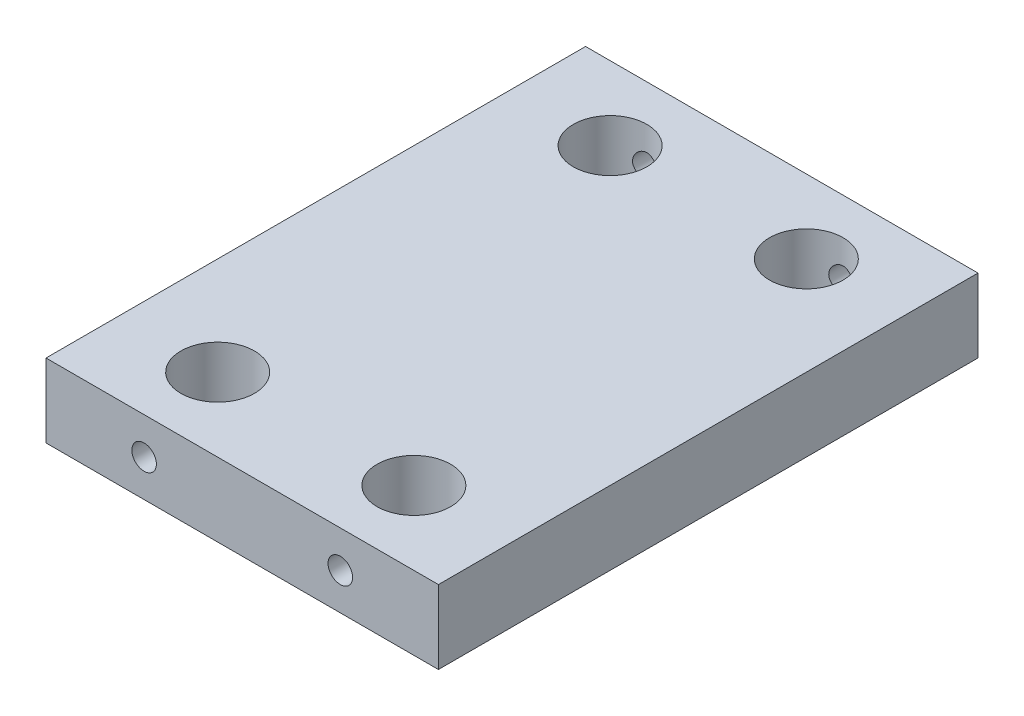
ISO-10303-21;
HEADER;
FILE_DESCRIPTION(('STEP AP214'),'2;1');
FILE_NAME('part.step','',(''),(''),'','','');
FILE_SCHEMA(('AUTOMOTIVE_DESIGN { 1 0 10303 214 1 1 1 1 }'));
ENDSEC;
DATA;
#1=APPLICATION_CONTEXT('core data for automotive mechanical design processes');
#2=APPLICATION_PROTOCOL_DEFINITION('international standard','automotive_design',2000,#1);
#3=PRODUCT_CONTEXT('',#1,'mechanical');
#4=PRODUCT('Part','Part','',(#3));
#5=PRODUCT_RELATED_PRODUCT_CATEGORY('part','',(#4));
#6=PRODUCT_DEFINITION_FORMATION('','',#4);
#7=PRODUCT_DEFINITION_CONTEXT('part definition',#1,'design');
#8=PRODUCT_DEFINITION('design','',#6,#7);
#9=PRODUCT_DEFINITION_SHAPE('','',#8);
#10=(LENGTH_UNIT() NAMED_UNIT(*) SI_UNIT(.MILLI.,.METRE.));
#11=(NAMED_UNIT(*) PLANE_ANGLE_UNIT() SI_UNIT($,.RADIAN.));
#12=(NAMED_UNIT(*) SI_UNIT($,.STERADIAN.) SOLID_ANGLE_UNIT());
#13=UNCERTAINTY_MEASURE_WITH_UNIT(LENGTH_MEASURE(1.E-05),#10,'distance_accuracy_value','');
#14=(GEOMETRIC_REPRESENTATION_CONTEXT(3) GLOBAL_UNCERTAINTY_ASSIGNED_CONTEXT((#13)) GLOBAL_UNIT_ASSIGNED_CONTEXT((#10,
#11,#12)) REPRESENTATION_CONTEXT('',''));
#15=CARTESIAN_POINT('',(0.,0.,0.));
#16=DIRECTION('',(0.,0.,1.));
#17=DIRECTION('',(1.,0.,0.));
#18=AXIS2_PLACEMENT_3D('',#15,#16,#17);
#19=CARTESIAN_POINT('',(50.8,19.05,-69.85));
#20=DIRECTION('',(-1.,0.,0.));
#21=DIRECTION('',(0.,0.,1.));
#22=AXIS2_PLACEMENT_3D('',#19,#20,#21);
#23=PLANE('',#22);
#24=DIRECTION('',(0.,0.,-1.));
#25=VECTOR('',#24,1.);
#26=CARTESIAN_POINT('',(50.8,0.,-69.85));
#27=LINE('',#26,#25);
#28=CARTESIAN_POINT('',(50.8,0.,69.85));
#29=VERTEX_POINT('',#28);
#30=CARTESIAN_POINT('',(50.8,0.,-69.85));
#31=VERTEX_POINT('',#30);
#32=EDGE_CURVE('E102',#29,#31,#27,.T.);
#33=ORIENTED_EDGE('',*,*,#32,.T.);
#34=DIRECTION('',(0.,-1.,0.));
#35=VECTOR('',#34,1.);
#36=CARTESIAN_POINT('',(50.8,19.05,-69.85));
#37=LINE('',#36,#35);
#38=CARTESIAN_POINT('',(50.8,19.05,-69.85));
#39=VERTEX_POINT('',#38);
#40=EDGE_CURVE('E11',#39,#31,#37,.T.);
#41=ORIENTED_EDGE('',*,*,#40,.F.);
#42=DIRECTION('',(0.,0.,-1.));
#43=VECTOR('',#42,1.);
#44=CARTESIAN_POINT('',(50.8,19.05,-69.85));
#45=LINE('',#44,#43);
#46=CARTESIAN_POINT('',(50.8,19.05,69.85));
#47=VERTEX_POINT('',#46);
#48=EDGE_CURVE('E89',#47,#39,#45,.T.);
#49=ORIENTED_EDGE('',*,*,#48,.F.);
#50=DIRECTION('',(0.,-1.,0.));
#51=VECTOR('',#50,1.);
#52=CARTESIAN_POINT('',(50.8,19.05,69.85));
#53=LINE('',#52,#51);
#54=EDGE_CURVE('E98',#47,#29,#53,.T.);
#55=ORIENTED_EDGE('',*,*,#54,.T.);
#56=EDGE_LOOP('',(#33,#41,#49,#55));
#57=FACE_BOUND('',#56,.T.);
#58=ADVANCED_FACE('F32',(#57),#23,.F.);
#59=CARTESIAN_POINT('',(-50.8,19.05,-69.85));
#60=DIRECTION('',(0.,0.,1.));
#61=DIRECTION('',(1.,0.,0.));
#62=AXIS2_PLACEMENT_3D('',#59,#60,#61);
#63=PLANE('',#62);
#64=CARTESIAN_POINT('',(-25.4000000000001,9.525,-69.85));
#65=DIRECTION('',(0.,0.,-1.));
#66=DIRECTION('',(-1.,0.,0.));
#67=AXIS2_PLACEMENT_3D('',#64,#65,#66);
#68=CIRCLE('',#67,3.175);
#69=CARTESIAN_POINT('',(-28.5750000000001,9.525,-69.85));
#70=VERTEX_POINT('',#69);
#71=EDGE_CURVE('E307',#70,#70,#68,.T.);
#72=ORIENTED_EDGE('',*,*,#71,.F.);
#73=EDGE_LOOP('',(#72));
#74=FACE_BOUND('',#73,.T.);
#75=CARTESIAN_POINT('',(25.4000000000001,9.525,-69.85));
#76=DIRECTION('',(0.,0.,-1.));
#77=DIRECTION('',(-1.,0.,0.));
#78=AXIS2_PLACEMENT_3D('',#75,#76,#77);
#79=CIRCLE('',#78,3.175);
#80=CARTESIAN_POINT('',(22.2250000000001,9.525,-69.85));
#81=VERTEX_POINT('',#80);
#82=EDGE_CURVE('E119',#81,#81,#79,.T.);
#83=ORIENTED_EDGE('',*,*,#82,.F.);
#84=EDGE_LOOP('',(#83));
#85=FACE_BOUND('',#84,.T.);
#86=DIRECTION('',(-1.,0.,0.));
#87=VECTOR('',#86,1.);
#88=CARTESIAN_POINT('',(-50.8,0.,-69.85));
#89=LINE('',#88,#87);
#90=CARTESIAN_POINT('',(-50.8,0.,-69.85));
#91=VERTEX_POINT('',#90);
#92=EDGE_CURVE('E93',#31,#91,#89,.T.);
#93=ORIENTED_EDGE('',*,*,#92,.T.);
#94=DIRECTION('',(0.,-1.,0.));
#95=VECTOR('',#94,1.);
#96=CARTESIAN_POINT('',(-50.8,19.05,-69.85));
#97=LINE('',#96,#95);
#98=CARTESIAN_POINT('',(-50.8,19.05,-69.85));
#99=VERTEX_POINT('',#98);
#100=EDGE_CURVE('E45',#99,#91,#97,.T.);
#101=ORIENTED_EDGE('',*,*,#100,.F.);
#102=DIRECTION('',(-1.,0.,0.));
#103=VECTOR('',#102,1.);
#104=CARTESIAN_POINT('',(-50.8,19.05,-69.85));
#105=LINE('',#104,#103);
#106=EDGE_CURVE('E84',#39,#99,#105,.T.);
#107=ORIENTED_EDGE('',*,*,#106,.F.);
#108=ORIENTED_EDGE('',*,*,#40,.T.);
#109=EDGE_LOOP('',(#93,#101,#107,#108));
#110=FACE_BOUND('',#109,.T.);
#111=ADVANCED_FACE('F92',(#74,#85,#110),#63,.F.);
#112=CARTESIAN_POINT('',(-50.8,19.05,-69.85));
#113=DIRECTION('',(1.,0.,0.));
#114=DIRECTION('',(0.,0.,-1.));
#115=AXIS2_PLACEMENT_3D('',#112,#113,#114);
#116=PLANE('',#115);
#117=DIRECTION('',(0.,0.,1.));
#118=VECTOR('',#117,1.);
#119=CARTESIAN_POINT('',(-50.8,0.,-69.85));
#120=LINE('',#119,#118);
#121=CARTESIAN_POINT('',(-50.8,0.,69.85));
#122=VERTEX_POINT('',#121);
#123=EDGE_CURVE('E71',#91,#122,#120,.T.);
#124=ORIENTED_EDGE('',*,*,#123,.T.);
#125=DIRECTION('',(0.,-1.,0.));
#126=VECTOR('',#125,1.);
#127=CARTESIAN_POINT('',(-50.8,19.05,69.85));
#128=LINE('',#127,#126);
#129=CARTESIAN_POINT('',(-50.8,19.05,69.85));
#130=VERTEX_POINT('',#129);
#131=EDGE_CURVE('E94',#130,#122,#128,.T.);
#132=ORIENTED_EDGE('',*,*,#131,.F.);
#133=DIRECTION('',(0.,0.,1.));
#134=VECTOR('',#133,1.);
#135=CARTESIAN_POINT('',(-50.8,19.05,-69.85));
#136=LINE('',#135,#134);
#137=EDGE_CURVE('E87',#99,#130,#136,.T.);
#138=ORIENTED_EDGE('',*,*,#137,.F.);
#139=ORIENTED_EDGE('',*,*,#100,.T.);
#140=EDGE_LOOP('',(#124,#132,#138,#139));
#141=FACE_BOUND('',#140,.T.);
#142=ADVANCED_FACE('F96',(#141),#116,.F.);
#143=CARTESIAN_POINT('',(-50.8,19.05,69.85));
#144=DIRECTION('',(0.,0.,-1.));
#145=DIRECTION('',(-1.,0.,0.));
#146=AXIS2_PLACEMENT_3D('',#143,#144,#145);
#147=PLANE('',#146);
#148=CARTESIAN_POINT('',(-25.4000000000001,9.525,69.85));
#149=DIRECTION('',(0.,0.,1.));
#150=DIRECTION('',(1.,0.,0.));
#151=AXIS2_PLACEMENT_3D('',#148,#149,#150);
#152=CIRCLE('',#151,3.175);
#153=CARTESIAN_POINT('',(-22.2250000000001,9.525,69.85));
#154=VERTEX_POINT('',#153);
#155=EDGE_CURVE('E262',#154,#154,#152,.T.);
#156=ORIENTED_EDGE('',*,*,#155,.F.);
#157=EDGE_LOOP('',(#156));
#158=FACE_BOUND('',#157,.T.);
#159=CARTESIAN_POINT('',(25.4000000000001,9.525,69.85));
#160=DIRECTION('',(0.,0.,1.));
#161=DIRECTION('',(1.,0.,0.));
#162=AXIS2_PLACEMENT_3D('',#159,#160,#161);
#163=CIRCLE('',#162,3.175);
#164=CARTESIAN_POINT('',(28.5750000000001,9.525,69.85));
#165=VERTEX_POINT('',#164);
#166=EDGE_CURVE('E261',#165,#165,#163,.T.);
#167=ORIENTED_EDGE('',*,*,#166,.F.);
#168=EDGE_LOOP('',(#167));
#169=FACE_BOUND('',#168,.T.);
#170=DIRECTION('',(1.,0.,0.));
#171=VECTOR('',#170,1.);
#172=CARTESIAN_POINT('',(-50.8,0.,69.85));
#173=LINE('',#172,#171);
#174=EDGE_CURVE('E77',#122,#29,#173,.T.);
#175=ORIENTED_EDGE('',*,*,#174,.T.);
#176=ORIENTED_EDGE('',*,*,#54,.F.);
#177=DIRECTION('',(1.,0.,0.));
#178=VECTOR('',#177,1.);
#179=CARTESIAN_POINT('',(-50.8,19.05,69.85));
#180=LINE('',#179,#178);
#181=EDGE_CURVE('E54',#130,#47,#180,.T.);
#182=ORIENTED_EDGE('',*,*,#181,.F.);
#183=ORIENTED_EDGE('',*,*,#131,.T.);
#184=EDGE_LOOP('',(#175,#176,#182,#183));
#185=FACE_BOUND('',#184,.T.);
#186=ADVANCED_FACE('F164',(#158,#169,#185),#147,.F.);
#187=CARTESIAN_POINT('',(50.8,19.05,69.85));
#188=DIRECTION('',(0.,1.,0.));
#189=DIRECTION('',(0.,0.,1.));
#190=AXIS2_PLACEMENT_3D('',#187,#188,#189);
#191=PLANE('',#190);
#192=CARTESIAN_POINT('',(25.4,19.05,50.8));
#193=DIRECTION('',(0.,1.,0.));
#194=DIRECTION('',(0.,0.,1.));
#195=AXIS2_PLACEMENT_3D('',#192,#193,#194);
#196=CIRCLE('',#195,9.525);
#197=CARTESIAN_POINT('',(25.4,19.05,60.325));
#198=VERTEX_POINT('',#197);
#199=EDGE_CURVE('E118',#198,#198,#196,.T.);
#200=ORIENTED_EDGE('',*,*,#199,.F.);
#201=EDGE_LOOP('',(#200));
#202=FACE_BOUND('',#201,.T.);
#203=CARTESIAN_POINT('',(25.4,19.05,-50.8));
#204=DIRECTION('',(0.,1.,0.));
#205=DIRECTION('',(0.,0.,1.));
#206=AXIS2_PLACEMENT_3D('',#203,#204,#205);
#207=CIRCLE('',#206,9.525);
#208=CARTESIAN_POINT('',(25.4,19.05,-41.275));
#209=VERTEX_POINT('',#208);
#210=EDGE_CURVE('E282',#209,#209,#207,.T.);
#211=ORIENTED_EDGE('',*,*,#210,.F.);
#212=EDGE_LOOP('',(#211));
#213=FACE_BOUND('',#212,.T.);
#214=CARTESIAN_POINT('',(-25.4,19.05,50.8));
#215=DIRECTION('',(0.,1.,0.));
#216=DIRECTION('',(0.,0.,1.));
#217=AXIS2_PLACEMENT_3D('',#214,#215,#216);
#218=CIRCLE('',#217,9.525);
#219=CARTESIAN_POINT('',(-25.4,19.05,60.325));
#220=VERTEX_POINT('',#219);
#221=EDGE_CURVE('E275',#220,#220,#218,.T.);
#222=ORIENTED_EDGE('',*,*,#221,.F.);
#223=EDGE_LOOP('',(#222));
#224=FACE_BOUND('',#223,.T.);
#225=CARTESIAN_POINT('',(-25.4,19.05,-50.8));
#226=DIRECTION('',(0.,1.,0.));
#227=DIRECTION('',(0.,0.,1.));
#228=AXIS2_PLACEMENT_3D('',#225,#226,#227);
#229=CIRCLE('',#228,9.525);
#230=CARTESIAN_POINT('',(-25.4,19.05,-41.275));
#231=VERTEX_POINT('',#230);
#232=EDGE_CURVE('E279',#231,#231,#229,.T.);
#233=ORIENTED_EDGE('',*,*,#232,.F.);
#234=EDGE_LOOP('',(#233));
#235=FACE_BOUND('',#234,.T.);
#236=ORIENTED_EDGE('',*,*,#48,.T.);
#237=ORIENTED_EDGE('',*,*,#106,.T.);
#238=ORIENTED_EDGE('',*,*,#137,.T.);
#239=ORIENTED_EDGE('',*,*,#181,.T.);
#240=EDGE_LOOP('',(#236,#237,#238,#239));
#241=FACE_BOUND('',#240,.T.);
#242=ADVANCED_FACE('F85',(#202,#213,#224,#235,#241),#191,.T.);
#243=CARTESIAN_POINT('',(50.8,0.,69.85));
#244=DIRECTION('',(0.,1.,0.));
#245=DIRECTION('',(0.,0.,1.));
#246=AXIS2_PLACEMENT_3D('',#243,#244,#245);
#247=PLANE('',#246);
#248=CARTESIAN_POINT('',(25.4,0.,50.8));
#249=DIRECTION('',(0.,1.,0.));
#250=DIRECTION('',(0.,0.,1.));
#251=AXIS2_PLACEMENT_3D('',#248,#249,#250);
#252=CIRCLE('',#251,9.525);
#253=CARTESIAN_POINT('',(25.4,0.,60.325));
#254=VERTEX_POINT('',#253);
#255=EDGE_CURVE('E297',#254,#254,#252,.T.);
#256=ORIENTED_EDGE('',*,*,#255,.T.);
#257=EDGE_LOOP('',(#256));
#258=FACE_BOUND('',#257,.T.);
#259=CARTESIAN_POINT('',(25.4,0.,-50.8));
#260=DIRECTION('',(0.,1.,0.));
#261=DIRECTION('',(0.,0.,1.));
#262=AXIS2_PLACEMENT_3D('',#259,#260,#261);
#263=CIRCLE('',#262,9.525);
#264=CARTESIAN_POINT('',(25.4,0.,-41.275));
#265=VERTEX_POINT('',#264);
#266=EDGE_CURVE('E277',#265,#265,#263,.T.);
#267=ORIENTED_EDGE('',*,*,#266,.T.);
#268=EDGE_LOOP('',(#267));
#269=FACE_BOUND('',#268,.T.);
#270=CARTESIAN_POINT('',(-25.4,0.,50.8));
#271=DIRECTION('',(0.,1.,0.));
#272=DIRECTION('',(0.,0.,1.));
#273=AXIS2_PLACEMENT_3D('',#270,#271,#272);
#274=CIRCLE('',#273,9.525);
#275=CARTESIAN_POINT('',(-25.4,0.,60.325));
#276=VERTEX_POINT('',#275);
#277=EDGE_CURVE('E272',#276,#276,#274,.T.);
#278=ORIENTED_EDGE('',*,*,#277,.T.);
#279=EDGE_LOOP('',(#278));
#280=FACE_BOUND('',#279,.T.);
#281=CARTESIAN_POINT('',(-25.4,0.,-50.8));
#282=DIRECTION('',(0.,1.,0.));
#283=DIRECTION('',(0.,0.,1.));
#284=AXIS2_PLACEMENT_3D('',#281,#282,#283);
#285=CIRCLE('',#284,9.525);
#286=CARTESIAN_POINT('',(-25.4,0.,-41.275));
#287=VERTEX_POINT('',#286);
#288=EDGE_CURVE('E105',#287,#287,#285,.T.);
#289=ORIENTED_EDGE('',*,*,#288,.T.);
#290=EDGE_LOOP('',(#289));
#291=FACE_BOUND('',#290,.T.);
#292=ORIENTED_EDGE('',*,*,#32,.F.);
#293=ORIENTED_EDGE('',*,*,#174,.F.);
#294=ORIENTED_EDGE('',*,*,#123,.F.);
#295=ORIENTED_EDGE('',*,*,#92,.F.);
#296=EDGE_LOOP('',(#292,#293,#294,#295));
#297=FACE_BOUND('',#296,.T.);
#298=ADVANCED_FACE('F154',(#258,#269,#280,#291,#297),#247,.F.);
#299=CARTESIAN_POINT('',(-25.4,19.05,-50.8));
#300=DIRECTION('',(0.,1.,0.));
#301=DIRECTION('',(0.,0.,1.));
#302=AXIS2_PLACEMENT_3D('',#299,#300,#301);
#303=CYLINDRICAL_SURFACE('',#302,9.525);
#304=CARTESIAN_POINT('',(-28.5750000000001,9.525,-59.7802561210691));
#305=CARTESIAN_POINT('',(-28.575000818984,9.69793645510453,-59.7802555513413));
#306=CARTESIAN_POINT('',(-28.5608229382016,9.87086798943991,-59.7853061749847));
#307=CARTESIAN_POINT('',(-28.504677343112,10.2116077866567,-59.8048579770798));
#308=CARTESIAN_POINT('',(-28.4627050511347,10.3794152008451,-59.8193607122645));
#309=CARTESIAN_POINT('',(-28.3526086670496,10.7049153852664,-59.8559954671191));
#310=CARTESIAN_POINT('',(-28.2845358279554,10.8626272759806,-59.8781125260894));
#311=CARTESIAN_POINT('',(-28.1243456703014,11.1644431541398,-59.9274621238278));
#312=CARTESIAN_POINT('',(-28.0322230466311,11.3085441296078,-59.9546957908897));
#313=CARTESIAN_POINT('',(-27.8226873899562,11.5846858804241,-60.0124050386873));
#314=CARTESIAN_POINT('',(-27.704492283875,11.7161164860327,-60.0429614113174));
#315=CARTESIAN_POINT('',(-27.4478358434058,11.9577065938882,-60.1031902074318));
#316=CARTESIAN_POINT('',(-27.3093712607914,12.067862680274,-60.1328624883195));
#317=CARTESIAN_POINT('',(-27.011644312789,12.2665454990215,-60.1889152747671));
#318=CARTESIAN_POINT('',(-26.8519335681379,12.354432906712,-60.215189694526));
#319=CARTESIAN_POINT('',(-26.5189691329853,12.5018532827798,-60.2605343799787));
#320=CARTESIAN_POINT('',(-26.345719107057,12.5613938928367,-60.2796065869453));
#321=CARTESIAN_POINT('',(-25.9969914953514,12.6483613384578,-60.307825644963));
#322=CARTESIAN_POINT('',(-25.8218011466582,12.676833441866,-60.3172947441875));
#323=CARTESIAN_POINT('',(-25.4688907525666,12.7041792314201,-60.3263845609294));
#324=CARTESIAN_POINT('',(-25.2911713709982,12.7030605464964,-60.3260078168469));
#325=CARTESIAN_POINT('',(-24.9456463392597,12.6719194917529,-60.3156667578947));
#326=CARTESIAN_POINT('',(-24.7777252457216,12.6430324720935,-60.306079055975));
#327=CARTESIAN_POINT('',(-24.4492670817397,12.559052285387,-60.2788662130365));
#328=CARTESIAN_POINT('',(-24.2887305125511,12.5039573422391,-60.26124052729));
#329=CARTESIAN_POINT('',(-23.9771158923768,12.3684623175533,-60.2194525318099));
#330=CARTESIAN_POINT('',(-23.826189898424,12.2877391451148,-60.1952073501375));
#331=CARTESIAN_POINT('',(-23.5396902664508,12.1035454352005,-60.1427039789857));
#332=CARTESIAN_POINT('',(-23.4041209133266,12.0000685724348,-60.1144446743966));
#333=CARTESIAN_POINT('',(-23.1454297486997,11.7675838007655,-60.0553215912342));
#334=CARTESIAN_POINT('',(-23.0231945013178,11.6376032238533,-60.0243978316119));
#335=CARTESIAN_POINT('',(-22.8019697007759,11.358725295818,-59.9645528941526));
#336=CARTESIAN_POINT('',(-22.7029837300812,11.2098250348135,-59.9356320254233));
#337=CARTESIAN_POINT('',(-22.5298398302616,10.8945247387091,-59.8827391725953));
#338=CARTESIAN_POINT('',(-22.4560559780023,10.7279054830661,-59.8588436197908));
#339=CARTESIAN_POINT('',(-22.3378928613699,10.3836108233692,-59.8195924136742));
#340=CARTESIAN_POINT('',(-22.2935012735018,10.2059400871702,-59.8042331817152));
#341=CARTESIAN_POINT('',(-22.2371879293404,9.85317322156826,-59.7846034530198));
#342=CARTESIAN_POINT('',(-22.2238916217633,9.67832257642302,-59.7798639401205));
#343=CARTESIAN_POINT('',(-22.2262527314617,9.32886072656272,-59.7806993378791));
#344=CARTESIAN_POINT('',(-22.2419048899051,9.15424948412384,-59.7862723751401));
#345=CARTESIAN_POINT('',(-22.3004835563215,8.81647663386469,-59.806637374367));
#346=CARTESIAN_POINT('',(-22.3424546991114,8.65312775927108,-59.8211060827467));
#347=CARTESIAN_POINT('',(-22.4513334863706,8.33582405019059,-59.857276579055));
#348=CARTESIAN_POINT('',(-22.5182455515462,8.18187088669928,-59.8789796491812));
#349=CARTESIAN_POINT('',(-22.6775189681539,7.88231716381078,-59.9280258636662));
#350=CARTESIAN_POINT('',(-22.7706201992118,7.73713640961228,-59.9555260648837));
#351=CARTESIAN_POINT('',(-22.9787906229798,7.46396128368169,-60.0127631572082));
#352=CARTESIAN_POINT('',(-23.0938662915414,7.33597199725063,-60.0425007060905));
#353=CARTESIAN_POINT('',(-23.3492938337665,7.09444865051222,-60.1025924767517));
#354=CARTESIAN_POINT('',(-23.4905954160144,6.98190631169015,-60.1329075335982));
#355=CARTESIAN_POINT('',(-23.7908233498042,6.78206624804496,-60.1893275387162));
#356=CARTESIAN_POINT('',(-23.9497490750551,6.69476762655931,-60.2154326365118));
#357=CARTESIAN_POINT('',(-24.2799239367775,6.54869116706406,-60.2603698844866));
#358=CARTESIAN_POINT('',(-24.4510841834553,6.48972769505489,-60.2792492026439));
#359=CARTESIAN_POINT('',(-24.801644370939,6.40166441895917,-60.3078108940993));
#360=CARTESIAN_POINT('',(-24.9810413130465,6.37255383512941,-60.3174965870801));
#361=CARTESIAN_POINT('',(-25.3339113086444,6.34599290360209,-60.3263291577511));
#362=CARTESIAN_POINT('',(-25.5072664984461,6.34711883376471,-60.3259499628397));
#363=CARTESIAN_POINT('',(-25.8512028853756,6.37748695336485,-60.3158622394909));
#364=CARTESIAN_POINT('',(-26.0217843064006,6.40672686188505,-60.306154467891));
#365=CARTESIAN_POINT('',(-26.3526337291968,6.49154859477868,-60.2786740498026));
#366=CARTESIAN_POINT('',(-26.5130225101482,6.54670463374557,-60.2610319529665));
#367=CARTESIAN_POINT('',(-26.8223312642339,6.68139866123347,-60.2194998523677));
#368=CARTESIAN_POINT('',(-26.9712491566523,6.76094106025052,-60.1956087185245));
#369=CARTESIAN_POINT('',(-27.2593880017805,6.94553320092388,-60.1429413352852));
#370=CARTESIAN_POINT('',(-27.3980473486955,7.05141682608671,-60.1140172016187));
#371=CARTESIAN_POINT('',(-27.656094758415,7.28426721692092,-60.0549023941422));
#372=CARTESIAN_POINT('',(-27.7754766486581,7.41124070918416,-60.0247113185458));
#373=CARTESIAN_POINT('',(-27.9963302430452,7.68860970398856,-59.9650591344627));
#374=CARTESIAN_POINT('',(-28.0969179170434,7.83972749735083,-59.935672863639));
#375=CARTESIAN_POINT('',(-28.2711980399811,8.15763680541632,-59.8824111380057));
#376=CARTESIAN_POINT('',(-28.3448975164019,8.32442421036919,-59.8585342438696));
#377=CARTESIAN_POINT('',(-28.4602041545483,8.66127879124963,-59.8202173610568));
#378=CARTESIAN_POINT('',(-28.5031113615498,8.83085693669304,-59.8053995932155));
#379=CARTESIAN_POINT('',(-28.560503966474,9.17529296023178,-59.7854209273797));
#380=CARTESIAN_POINT('',(-28.5749991719492,9.350148995279,-59.7802566971044));
#381=CARTESIAN_POINT('',(-28.5750000000001,9.525,-59.7802561210691));
#382=B_SPLINE_CURVE_WITH_KNOTS('',3,(#304,#305,#306,#307,#308,#309,#310,#311,#312,#313,#314,
#315,#316,#317,#318,#319,#320,#321,#322,#323,#324,#325,#326,#327,#328,#329,#330,#331,#332,#333,
#334,#335,#336,#337,#338,#339,#340,#341,#342,#343,#344,#345,#346,#347,#348,#349,#350,#351,#352,
#353,#354,#355,#356,#357,#358,#359,#360,#361,#362,#363,#364,#365,#366,#367,#368,#369,#370,#371,
#372,#373,#374,#375,#376,#377,#378,#379,#380,#381),.UNSPECIFIED.,.T.,.F.,(4,2,2,2,2,2,2,2,2,2,2,
2,2,2,2,2,2,2,2,2,2,2,2,2,2,2,2,2,2,2,2,2,2,2,2,2,2,2,4),(0.,0.518161856737954,1.03640907467314,
1.55364379231512,2.07099270263877,2.60671746332528,3.14252816921061,3.69231882006111,
4.24196117528055,4.77247962078665,5.30286129234889,5.81244090321181,6.32205505300826,
6.83836754181563,7.35482374200019,7.89559553605437,8.43645060268435,8.985016315017,
9.53335188057253,10.0569487508209,10.5804505128322,11.0859695656586,11.5915782629155,
12.1132237331089,12.6350231697725,13.1819271594322,13.7288117205516,14.2720628703095,
14.815117785382,15.3326491885149,15.8501386073105,16.3594083542836,16.8687702617329,
17.3969527447801,17.925304015736,18.4743376618726,19.023227709973,19.5473069861654,
20.0712053232972),.UNSPECIFIED.);
#383=CARTESIAN_POINT('',(-28.5750000000001,9.525,-59.7802561210691));
#384=VERTEX_POINT('',#383);
#385=EDGE_CURVE('E35',#384,#384,#382,.T.);
#386=ORIENTED_EDGE('',*,*,#385,.T.);
#387=EDGE_LOOP('',(#386));
#388=FACE_BOUND('',#387,.T.);
#389=ORIENTED_EDGE('',*,*,#288,.F.);
#390=EDGE_LOOP('',(#389));
#391=FACE_BOUND('',#390,.T.);
#392=ORIENTED_EDGE('',*,*,#232,.T.);
#393=EDGE_LOOP('',(#392));
#394=FACE_BOUND('',#393,.T.);
#395=ADVANCED_FACE('F156',(#388,#391,#394),#303,.F.);
#396=CARTESIAN_POINT('',(-25.4,19.05,50.8));
#397=DIRECTION('',(0.,1.,0.));
#398=DIRECTION('',(0.,0.,1.));
#399=AXIS2_PLACEMENT_3D('',#396,#397,#398);
#400=CYLINDRICAL_SURFACE('',#399,9.525);
#401=CARTESIAN_POINT('',(-25.4,6.35,60.325));
#402=CARTESIAN_POINT('',(-25.2267613228347,6.34999919440205,60.325000485805));
#403=CARTESIAN_POINT('',(-25.0535275073401,6.36422484495392,60.3202301818645));
#404=CARTESIAN_POINT('',(-24.7121624092283,6.42057742049469,60.3016704239542));
#405=CARTESIAN_POINT('',(-24.5440316582228,6.46270724203785,60.2878800336683));
#406=CARTESIAN_POINT('',(-24.2178433933319,6.57326359774438,60.2527785260295));
#407=CARTESIAN_POINT('',(-24.0597695528119,6.64164617330822,60.2314799854546));
#408=CARTESIAN_POINT('',(-23.7573345756431,6.80256822376179,60.1835361515256));
#409=CARTESIAN_POINT('',(-23.6129761516561,6.8951124638833,60.1568898037019));
#410=CARTESIAN_POINT('',(-23.3370701818043,7.10509693042659,60.1000224985654));
#411=CARTESIAN_POINT('',(-23.2060632515529,7.22322416877712,60.0697159177252));
#412=CARTESIAN_POINT('',(-22.9653062006709,7.4795607161934,60.0094149943641));
#413=CARTESIAN_POINT('',(-22.855560761071,7.61777443589808,59.9794207219749));
#414=CARTESIAN_POINT('',(-22.6573558084266,7.91522774074882,59.9221983061534));
#415=CARTESIAN_POINT('',(-22.5695990751483,8.07495762364955,59.8950744970031));
#416=CARTESIAN_POINT('',(-22.4224250754383,8.40795909990595,59.8479659470406));
#417=CARTESIAN_POINT('',(-22.3629991607971,8.58122654199178,59.8279790281037));
#418=CARTESIAN_POINT('',(-22.2762017597085,8.93023747825212,59.7983088788027));
#419=CARTESIAN_POINT('',(-22.2478173017372,9.10570063695285,59.7883010406852));
#420=CARTESIAN_POINT('',(-22.2207419334131,9.45916241944499,59.7787620979869));
#421=CARTESIAN_POINT('',(-22.2220418474051,9.63716024275174,59.7792277559717));
#422=CARTESIAN_POINT('',(-22.2535118057417,9.98199880165983,59.7902987265097));
#423=CARTESIAN_POINT('',(-22.2823598256949,10.1489776792679,59.8004397037942));
#424=CARTESIAN_POINT('',(-22.3659504329532,10.4755741072518,59.8289588827545));
#425=CARTESIAN_POINT('',(-22.4206961205709,10.6351907737564,59.8473380706454));
#426=CARTESIAN_POINT('',(-22.5553934906589,10.945535479953,59.8905936784172));
#427=CARTESIAN_POINT('',(-22.6357368953545,11.0960789808658,59.9155699639315));
#428=CARTESIAN_POINT('',(-22.8190770874876,11.3819651337882,59.9691637347793));
#429=CARTESIAN_POINT('',(-22.9220804182444,11.5173033780135,59.9977822708472));
#430=CARTESIAN_POINT('',(-23.154165868734,11.7763658241605,60.0572627010758));
#431=CARTESIAN_POINT('',(-23.2843287485078,11.8991148050663,60.0881637120163));
#432=CARTESIAN_POINT('',(-23.5637718653452,12.1212967716563,60.1474202937884));
#433=CARTESIAN_POINT('',(-23.713053933777,12.2207275211723,60.1757756203337));
#434=CARTESIAN_POINT('',(-24.0285663285782,12.3942357532464,60.227118177025));
#435=CARTESIAN_POINT('',(-24.1949500973783,12.4680519350068,60.2500493627553));
#436=CARTESIAN_POINT('',(-24.5387206603178,12.5863450773094,60.2875530068358));
#437=CARTESIAN_POINT('',(-24.7161036088582,12.6308322294694,60.3021283685424));
#438=CARTESIAN_POINT('',(-25.0685813412446,12.687476739621,60.3207971595182));
#439=CARTESIAN_POINT('',(-25.2434420204292,12.7009518941235,60.3253175582209));
#440=CARTESIAN_POINT('',(-25.5929608471239,12.6989437613249,60.3246476605608));
#441=CARTESIAN_POINT('',(-25.76761902384,12.6834653620639,60.3194590033147));
#442=CARTESIAN_POINT('',(-26.1065005755161,12.6250321929383,60.300235784768));
#443=CARTESIAN_POINT('',(-26.2708796617008,12.5828862957928,60.2864618090803));
#444=CARTESIAN_POINT('',(-26.5901676684903,12.4733258138181,60.2517161368547));
#445=CARTESIAN_POINT('',(-26.7450753785149,12.4059080066898,60.2307435224819));
#446=CARTESIAN_POINT('',(-27.0455653410488,12.2457513789055,60.1830435683714));
#447=CARTESIAN_POINT('',(-27.1907951205146,12.1523931663259,60.1561793684962));
#448=CARTESIAN_POINT('',(-27.4639558356806,11.9437335737071,60.0997418118413));
#449=CARTESIAN_POINT('',(-27.5918814677511,11.8284254920991,60.070167629104));
#450=CARTESIAN_POINT('',(-27.8328517122851,11.572942465554,60.0099399233791));
#451=CARTESIAN_POINT('',(-27.9449560773554,11.4318757045072,59.9792984145258));
#452=CARTESIAN_POINT('',(-28.1440176333774,11.1322752722004,59.921774152107));
#453=CARTESIAN_POINT('',(-28.2309746146811,10.9737414553367,59.8948914298785));
#454=CARTESIAN_POINT('',(-28.376870254072,10.6436381764545,59.8481909393764));
#455=CARTESIAN_POINT('',(-28.435865569624,10.4720958986391,59.828358905177));
#456=CARTESIAN_POINT('',(-28.523865566961,10.1206977861098,59.7982939257297));
#457=CARTESIAN_POINT('',(-28.5528837594788,9.94084573484112,59.7880566563005));
#458=CARTESIAN_POINT('',(-28.5790521968656,9.58787422007002,59.7788320192551));
#459=CARTESIAN_POINT('',(-28.5777630669542,9.41488356958927,59.7792937081729));
#460=CARTESIAN_POINT('',(-28.5471942816996,9.07172088712239,59.7900528169078));
#461=CARTESIAN_POINT('',(-28.5179162922811,8.90154868799253,59.8003496513272));
#462=CARTESIAN_POINT('',(-28.4333055066857,8.57206926996709,59.8292086466803));
#463=CARTESIAN_POINT('',(-28.3784781235993,8.41261708061067,59.8476101122136));
#464=CARTESIAN_POINT('',(-28.2447344862872,8.10505298297094,59.8905456624864));
#465=CARTESIAN_POINT('',(-28.1658128851584,7.95694360097803,59.9150811082377));
#466=CARTESIAN_POINT('',(-27.9821026989524,7.66926434799471,59.968854827927));
#467=CARTESIAN_POINT('',(-27.8763356707776,7.53034910647258,59.9982515946378));
#468=CARTESIAN_POINT('',(-27.6435911539557,7.27173484250512,60.0577715619933));
#469=CARTESIAN_POINT('',(-27.5166076681335,7.15204127219033,60.0878949659678));
#470=CARTESIAN_POINT('',(-27.2390919432232,6.93056649098183,60.146883469186));
#471=CARTESIAN_POINT('',(-27.0878348053616,6.82966519589055,60.1756537721899));
#472=CARTESIAN_POINT('',(-26.769559609766,6.65483038839917,60.2274002197304));
#473=CARTESIAN_POINT('',(-26.6025455950702,6.58088998169749,60.2503778450768));
#474=CARTESIAN_POINT('',(-26.2651673298631,6.46518381684845,60.2870751034262));
#475=CARTESIAN_POINT('',(-26.0952861306226,6.42212816961377,60.3011624944151));
#476=CARTESIAN_POINT('',(-25.7502673208325,6.36454060885012,60.320123424289));
#477=CARTESIAN_POINT('',(-25.5751311761808,6.3500008143985,60.324999508888));
#478=CARTESIAN_POINT('',(-25.4,6.35,60.325));
#479=B_SPLINE_CURVE_WITH_KNOTS('',3,(#401,#402,#403,#404,#405,#406,#407,#408,#409,#410,#411,
#412,#413,#414,#415,#416,#417,#418,#419,#420,#421,#422,#423,#424,#425,#426,#427,#428,#429,#430,
#431,#432,#433,#434,#435,#436,#437,#438,#439,#440,#441,#442,#443,#444,#445,#446,#447,#448,#449,
#450,#451,#452,#453,#454,#455,#456,#457,#458,#459,#460,#461,#462,#463,#464,#465,#466,#467,#468,
#469,#470,#471,#472,#473,#474,#475,#476,#477,#478),.UNSPECIFIED.,.T.,.F.,(4,2,2,2,2,2,2,2,2,2,2,
2,2,2,2,2,2,2,2,2,2,2,2,2,2,2,2,2,2,2,2,2,2,2,2,2,2,2,4),(0.,0.519071561632583,1.03819701322438,
1.55645698636312,2.07481924951214,2.6093637259775,3.14402575687909,3.69406121814519,
4.24392866899746,4.77526114230342,5.30642937910266,5.81332424300314,6.32027980466155,
6.83539943417539,7.35066800622308,7.8928374595109,8.43505888444013,8.98265937939885,
9.53006948685135,10.0537512658116,10.5773446429626,11.0857715158083,11.5942632377703,
12.1161301950386,12.638156741095,13.1839024764639,13.7296527614611,14.274292439,
14.8186865394104,15.3351123975402,15.8515075194061,16.3580948898032,16.8647947620873,
17.3936046174648,17.92256420318,18.4721392315144,19.0215736265905,19.5464607283686,
20.0712027467109),.UNSPECIFIED.);
#480=CARTESIAN_POINT('',(-25.4,6.35,60.325));
#481=VERTEX_POINT('',#480);
#482=EDGE_CURVE('E257',#481,#481,#479,.T.);
#483=ORIENTED_EDGE('',*,*,#482,.T.);
#484=EDGE_LOOP('',(#483));
#485=FACE_BOUND('',#484,.T.);
#486=ORIENTED_EDGE('',*,*,#277,.F.);
#487=EDGE_LOOP('',(#486));
#488=FACE_BOUND('',#487,.T.);
#489=ORIENTED_EDGE('',*,*,#221,.T.);
#490=EDGE_LOOP('',(#489));
#491=FACE_BOUND('',#490,.T.);
#492=ADVANCED_FACE('F142',(#485,#488,#491),#400,.F.);
#493=CARTESIAN_POINT('',(25.4,19.05,-50.8));
#494=DIRECTION('',(0.,1.,0.));
#495=DIRECTION('',(0.,0.,1.));
#496=AXIS2_PLACEMENT_3D('',#493,#494,#495);
#497=CYLINDRICAL_SURFACE('',#496,9.525);
#498=CARTESIAN_POINT('',(22.2250000000001,9.525,-59.7802561210692));
#499=CARTESIAN_POINT('',(22.2249991810161,9.69793645510453,-59.7802555513413));
#500=CARTESIAN_POINT('',(22.2391770617985,9.87086798943991,-59.7853061749847));
#501=CARTESIAN_POINT('',(22.2953226568881,10.2116077866567,-59.8048579770799));
#502=CARTESIAN_POINT('',(22.3372949488654,10.3794152008451,-59.8193607122645));
#503=CARTESIAN_POINT('',(22.4473913329505,10.7049153852664,-59.8559954671192));
#504=CARTESIAN_POINT('',(22.5154641720448,10.8626272759806,-59.8781125260895));
#505=CARTESIAN_POINT('',(22.6756543296987,11.1644431541398,-59.9274621238278));
#506=CARTESIAN_POINT('',(22.767776953369,11.3085441296078,-59.9546957908897));
#507=CARTESIAN_POINT('',(22.9773126100439,11.5846858804241,-60.0124050386873));
#508=CARTESIAN_POINT('',(23.0955077161252,11.7161164860327,-60.0429614113175));
#509=CARTESIAN_POINT('',(23.3521641565944,11.9577065938882,-60.1031902074319));
#510=CARTESIAN_POINT('',(23.4906287392088,12.067862680274,-60.1328624883195));
#511=CARTESIAN_POINT('',(23.7883556872112,12.2665454990215,-60.1889152747671));
#512=CARTESIAN_POINT('',(23.9480664318622,12.354432906712,-60.215189694526));
#513=CARTESIAN_POINT('',(24.2810308670148,12.5018532827798,-60.2605343799787));
#514=CARTESIAN_POINT('',(24.4542808929432,12.5613938928367,-60.2796065869453));
#515=CARTESIAN_POINT('',(24.8030085046487,12.6483613384578,-60.307825644963));
#516=CARTESIAN_POINT('',(24.9781988533419,12.676833441866,-60.3172947441875));
#517=CARTESIAN_POINT('',(25.3311092474336,12.7041792314201,-60.3263845609294));
#518=CARTESIAN_POINT('',(25.5088286290019,12.7030605464964,-60.3260078168469));
#519=CARTESIAN_POINT('',(25.8543536607404,12.6719194917529,-60.3156667578947));
#520=CARTESIAN_POINT('',(26.0222747542786,12.6430324720935,-60.306079055975));
#521=CARTESIAN_POINT('',(26.3507329182605,12.559052285387,-60.2788662130365));
#522=CARTESIAN_POINT('',(26.5112694874491,12.5039573422391,-60.26124052729));
#523=CARTESIAN_POINT('',(26.8228841076233,12.3684623175533,-60.2194525318098));
#524=CARTESIAN_POINT('',(26.9738101015761,12.2877391451148,-60.1952073501375));
#525=CARTESIAN_POINT('',(27.2603097335493,12.1035454352005,-60.1427039789857));
#526=CARTESIAN_POINT('',(27.3958790866735,12.0000685724348,-60.1144446743966));
#527=CARTESIAN_POINT('',(27.6545702513005,11.7675838007655,-60.0553215912342));
#528=CARTESIAN_POINT('',(27.7768054986823,11.6376032238533,-60.0243978316118));
#529=CARTESIAN_POINT('',(27.9980302992243,11.358725295818,-59.9645528941526));
#530=CARTESIAN_POINT('',(28.097016269919,11.2098250348135,-59.9356320254233));
#531=CARTESIAN_POINT('',(28.2701601697385,10.8945247387091,-59.8827391725953));
#532=CARTESIAN_POINT('',(28.3439440219978,10.7279054830661,-59.8588436197907));
#533=CARTESIAN_POINT('',(28.4621071386302,10.3836108233692,-59.8195924136742));
#534=CARTESIAN_POINT('',(28.5064987264984,10.2059400871702,-59.8042331817152));
#535=CARTESIAN_POINT('',(28.5628120706597,9.85317322156825,-59.7846034530198));
#536=CARTESIAN_POINT('',(28.5761083782368,9.67832257642301,-59.7798639401205));
#537=CARTESIAN_POINT('',(28.5737472685384,9.32886072656271,-59.7806993378791));
#538=CARTESIAN_POINT('',(28.558095110095,9.15424948412383,-59.7862723751401));
#539=CARTESIAN_POINT('',(28.4995164436786,8.81647663386469,-59.806637374367));
#540=CARTESIAN_POINT('',(28.4575453008887,8.65312775927108,-59.8211060827467));
#541=CARTESIAN_POINT('',(28.3486665136295,8.33582405019059,-59.857276579055));
#542=CARTESIAN_POINT('',(28.2817544484539,8.18187088669928,-59.8789796491811));
#543=CARTESIAN_POINT('',(28.1224810318462,7.88231716381078,-59.9280258636662));
#544=CARTESIAN_POINT('',(28.0293798007883,7.73713640961228,-59.9555260648837));
#545=CARTESIAN_POINT('',(27.8212093770203,7.46396128368169,-60.0127631572081));
#546=CARTESIAN_POINT('',(27.7061337084587,7.33597199725063,-60.0425007060905));
#547=CARTESIAN_POINT('',(27.4507061662336,7.09444865051223,-60.1025924767517));
#548=CARTESIAN_POINT('',(27.3094045839857,6.98190631169016,-60.1329075335982));
#549=CARTESIAN_POINT('',(27.0091766501959,6.78206624804497,-60.1893275387162));
#550=CARTESIAN_POINT('',(26.850250924945,6.69476762655931,-60.2154326365118));
#551=CARTESIAN_POINT('',(26.5200760632226,6.54869116706406,-60.2603698844866));
#552=CARTESIAN_POINT('',(26.3489158165449,6.4897276950549,-60.2792492026439));
#553=CARTESIAN_POINT('',(25.9983556290612,6.40166441895917,-60.3078108940993));
#554=CARTESIAN_POINT('',(25.8189586869537,6.37255383512941,-60.3174965870801));
#555=CARTESIAN_POINT('',(25.4660886913557,6.34599290360209,-60.3263291577511));
#556=CARTESIAN_POINT('',(25.292733501554,6.34711883376471,-60.3259499628397));
#557=CARTESIAN_POINT('',(24.9487971146245,6.37748695336485,-60.3158622394909));
#558=CARTESIAN_POINT('',(24.7782156935996,6.40672686188504,-60.306154467891));
#559=CARTESIAN_POINT('',(24.4473662708033,6.49154859477868,-60.2786740498026));
#560=CARTESIAN_POINT('',(24.286977489852,6.54670463374556,-60.2610319529665));
#561=CARTESIAN_POINT('',(23.9776687357662,6.68139866123347,-60.2194998523677));
#562=CARTESIAN_POINT('',(23.8287508433478,6.76094106025052,-60.1956087185245));
#563=CARTESIAN_POINT('',(23.5406119982197,6.94553320092388,-60.1429413352852));
#564=CARTESIAN_POINT('',(23.4019526513047,7.05141682608671,-60.1140172016187));
#565=CARTESIAN_POINT('',(23.1439052415851,7.28426721692092,-60.0549023941422));
#566=CARTESIAN_POINT('',(23.024523351342,7.41124070918416,-60.0247113185458));
#567=CARTESIAN_POINT('',(22.8036697569549,7.68860970398856,-59.9650591344628));
#568=CARTESIAN_POINT('',(22.7030820829567,7.83972749735083,-59.935672863639));
#569=CARTESIAN_POINT('',(22.528801960019,8.15763680541633,-59.8824111380058));
#570=CARTESIAN_POINT('',(22.4551024835982,8.32442421036919,-59.8585342438697));
#571=CARTESIAN_POINT('',(22.3397958454518,8.66127879124963,-59.8202173610569));
#572=CARTESIAN_POINT('',(22.2968886384503,8.83085693669304,-59.8053995932156));
#573=CARTESIAN_POINT('',(22.2394960335261,9.17529296023178,-59.7854209273797));
#574=CARTESIAN_POINT('',(22.2250008280509,9.350148995279,-59.7802566971044));
#575=CARTESIAN_POINT('',(22.2250000000001,9.525,-59.7802561210692));
#576=B_SPLINE_CURVE_WITH_KNOTS('',3,(#498,#499,#500,#501,#502,#503,#504,#505,#506,#507,#508,
#509,#510,#511,#512,#513,#514,#515,#516,#517,#518,#519,#520,#521,#522,#523,#524,#525,#526,#527,
#528,#529,#530,#531,#532,#533,#534,#535,#536,#537,#538,#539,#540,#541,#542,#543,#544,#545,#546,
#547,#548,#549,#550,#551,#552,#553,#554,#555,#556,#557,#558,#559,#560,#561,#562,#563,#564,#565,
#566,#567,#568,#569,#570,#571,#572,#573,#574,#575),.UNSPECIFIED.,.T.,.F.,(4,2,2,2,2,2,2,2,2,2,2,
2,2,2,2,2,2,2,2,2,2,2,2,2,2,2,2,2,2,2,2,2,2,2,2,2,2,2,4),(0.,0.518161856737954,1.03640907467315,
1.55364379231513,2.07099270263878,2.60671746332529,3.14252816921062,3.69231882006112,
4.24196117528055,4.77247962078666,5.30286129234889,5.81244090321181,6.32205505300826,
6.83836754181563,7.35482374200019,7.89559553605438,8.43645060268436,8.985016315017,
9.53335188057254,10.0569487508209,10.5804505128322,11.0859695656586,11.5915782629155,
12.1132237331089,12.6350231697725,13.1819271594322,13.7288117205516,14.2720628703095,
14.815117785382,15.3326491885149,15.8501386073105,16.3594083542836,16.8687702617329,
17.3969527447801,17.925304015736,18.4743376618726,19.023227709973,19.5473069861654,
20.0712053232972),.UNSPECIFIED.);
#577=CARTESIAN_POINT('',(22.2250000000001,9.525,-59.7802561210692));
#578=VERTEX_POINT('',#577);
#579=EDGE_CURVE('E111',#578,#578,#576,.T.);
#580=ORIENTED_EDGE('',*,*,#579,.T.);
#581=EDGE_LOOP('',(#580));
#582=FACE_BOUND('',#581,.T.);
#583=ORIENTED_EDGE('',*,*,#266,.F.);
#584=EDGE_LOOP('',(#583));
#585=FACE_BOUND('',#584,.T.);
#586=ORIENTED_EDGE('',*,*,#210,.T.);
#587=EDGE_LOOP('',(#586));
#588=FACE_BOUND('',#587,.T.);
#589=ADVANCED_FACE('F125',(#582,#585,#588),#497,.F.);
#590=CARTESIAN_POINT('',(25.4,19.05,50.8));
#591=DIRECTION('',(0.,1.,0.));
#592=DIRECTION('',(0.,0.,1.));
#593=AXIS2_PLACEMENT_3D('',#590,#591,#592);
#594=CYLINDRICAL_SURFACE('',#593,9.525);
#595=CARTESIAN_POINT('',(25.4,6.35,60.325));
#596=CARTESIAN_POINT('',(25.5732386771653,6.34999919440204,60.325000485805));
#597=CARTESIAN_POINT('',(25.7464724926599,6.36422484495391,60.3202301818645));
#598=CARTESIAN_POINT('',(26.0878375907717,6.42057742049466,60.3016704239542));
#599=CARTESIAN_POINT('',(26.2559683417772,6.46270724203781,60.2878800336683));
#600=CARTESIAN_POINT('',(26.5821566066681,6.57326359774433,60.2527785260295));
#601=CARTESIAN_POINT('',(26.7402304471882,6.64164617330816,60.2314799854546));
#602=CARTESIAN_POINT('',(27.0426654243569,6.80256822376172,60.1835361515256));
#603=CARTESIAN_POINT('',(27.1870238483439,6.89511246388323,60.156889803702));
#604=CARTESIAN_POINT('',(27.4629298181957,7.1050969304265,60.1000224985654));
#605=CARTESIAN_POINT('',(27.5939367484471,7.22322416877703,60.0697159177252));
#606=CARTESIAN_POINT('',(27.8346937993291,7.4795607161933,60.0094149943641));
#607=CARTESIAN_POINT('',(27.9444392389291,7.61777443589798,59.9794207219749));
#608=CARTESIAN_POINT('',(28.1426441915735,7.91522774074871,59.9221983061534));
#609=CARTESIAN_POINT('',(28.2304009248518,8.07495762364944,59.8950744970031));
#610=CARTESIAN_POINT('',(28.3775749245618,8.40795909990583,59.8479659470406));
#611=CARTESIAN_POINT('',(28.437000839203,8.58122654199165,59.8279790281037));
#612=CARTESIAN_POINT('',(28.5237982402916,8.930237478252,59.7983088788027));
#613=CARTESIAN_POINT('',(28.5521826982629,9.10570063695272,59.7883010406851));
#614=CARTESIAN_POINT('',(28.579258066587,9.45916241944486,59.7787620979868));
#615=CARTESIAN_POINT('',(28.577958152595,9.63716024275162,59.7792277559717));
#616=CARTESIAN_POINT('',(28.5464881942584,9.98199880165971,59.7902987265097));
#617=CARTESIAN_POINT('',(28.5176401743053,10.1489776792678,59.8004397037941));
#618=CARTESIAN_POINT('',(28.434049567047,10.4755741072516,59.8289588827545));
#619=CARTESIAN_POINT('',(28.3793038794293,10.6351907737563,59.8473380706454));
#620=CARTESIAN_POINT('',(28.2446065093413,10.9455354799529,59.8905936784171));
#621=CARTESIAN_POINT('',(28.1642631046456,11.0960789808657,59.9155699639314));
#622=CARTESIAN_POINT('',(27.9809229125126,11.3819651337881,59.9691637347793));
#623=CARTESIAN_POINT('',(27.8779195817558,11.5173033780134,59.9977822708472));
#624=CARTESIAN_POINT('',(27.6458341312662,11.7763658241604,60.0572627010757));
#625=CARTESIAN_POINT('',(27.5156712514924,11.8991148050663,60.0881637120162));
#626=CARTESIAN_POINT('',(27.2362281346551,12.1212967716562,60.1474202937884));
#627=CARTESIAN_POINT('',(27.0869460662232,12.2207275211722,60.1757756203336));
#628=CARTESIAN_POINT('',(26.771433671422,12.3942357532463,60.2271181770249));
#629=CARTESIAN_POINT('',(26.605049902622,12.4680519350068,60.2500493627552));
#630=CARTESIAN_POINT('',(26.2612793396824,12.5863450773094,60.2875530068358));
#631=CARTESIAN_POINT('',(26.0838963911421,12.6308322294694,60.3021283685424));
#632=CARTESIAN_POINT('',(25.7314186587557,12.687476739621,60.3207971595182));
#633=CARTESIAN_POINT('',(25.556557979571,12.7009518941235,60.3253175582209));
#634=CARTESIAN_POINT('',(25.2070391528764,12.6989437613249,60.3246476605608));
#635=CARTESIAN_POINT('',(25.0323809761602,12.6834653620639,60.3194590033147));
#636=CARTESIAN_POINT('',(24.6934994244841,12.6250321929383,60.3002357847681));
#637=CARTESIAN_POINT('',(24.5291203382995,12.5828862957929,60.2864618090804));
#638=CARTESIAN_POINT('',(24.20983233151,12.4733258138182,60.2517161368547));
#639=CARTESIAN_POINT('',(24.0549246214853,12.4059080066898,60.2307435224819));
#640=CARTESIAN_POINT('',(23.7544346589515,12.2457513789055,60.1830435683715));
#641=CARTESIAN_POINT('',(23.6092048794857,12.152393166326,60.1561793684962));
#642=CARTESIAN_POINT('',(23.3360441643196,11.9437335737072,60.0997418118414));
#643=CARTESIAN_POINT('',(23.2081185322492,11.8284254920992,60.070167629104));
#644=CARTESIAN_POINT('',(22.9671482877151,11.5729424655541,60.0099399233792));
#645=CARTESIAN_POINT('',(22.8550439226448,11.4318757045073,59.9792984145259));
#646=CARTESIAN_POINT('',(22.6559823666227,11.1322752722005,59.921774152107));
#647=CARTESIAN_POINT('',(22.5690253853191,10.9737414553369,59.8948914298786));
#648=CARTESIAN_POINT('',(22.4231297459281,10.6436381764546,59.8481909393765));
#649=CARTESIAN_POINT('',(22.3641344303761,10.4720958986392,59.8283589051771));
#650=CARTESIAN_POINT('',(22.2761344330391,10.1206977861099,59.7982939257298));
#651=CARTESIAN_POINT('',(22.2471162405213,9.94084573484125,59.7880566563006));
#652=CARTESIAN_POINT('',(22.2209478031345,9.58787422007015,59.7788320192551));
#653=CARTESIAN_POINT('',(22.2222369330459,9.4148835695894,59.779293708173));
#654=CARTESIAN_POINT('',(22.2528057183005,9.07172088712251,59.7900528169078));
#655=CARTESIAN_POINT('',(22.282083707719,8.90154868799265,59.8003496513272));
#656=CARTESIAN_POINT('',(22.3666944933144,8.57206926996721,59.8292086466803));
#657=CARTESIAN_POINT('',(22.4215218764008,8.41261708061078,59.8476101122137));
#658=CARTESIAN_POINT('',(22.5552655137128,8.10505298297105,59.8905456624864));
#659=CARTESIAN_POINT('',(22.6341871148417,7.95694360097813,59.9150811082377));
#660=CARTESIAN_POINT('',(22.8178973010476,7.6692643479948,59.968854827927));
#661=CARTESIAN_POINT('',(22.9236643292225,7.53034910647267,59.9982515946379));
#662=CARTESIAN_POINT('',(23.1564088460443,7.27173484250521,60.0577715619933));
#663=CARTESIAN_POINT('',(23.2833923318666,7.1520412721904,60.0878949659678));
#664=CARTESIAN_POINT('',(23.5609080567768,6.93056649098189,60.146883469186));
#665=CARTESIAN_POINT('',(23.7121651946384,6.82966519589061,60.1756537721899));
#666=CARTESIAN_POINT('',(24.030440390234,6.65483038839922,60.2274002197304));
#667=CARTESIAN_POINT('',(24.1974544049298,6.58088998169754,60.2503778450768));
#668=CARTESIAN_POINT('',(24.5348326701369,6.46518381684849,60.2870751034262));
#669=CARTESIAN_POINT('',(24.7047138693774,6.4221281696138,60.3011624944151));
#670=CARTESIAN_POINT('',(25.0497326791675,6.36454060885013,60.320123424289));
#671=CARTESIAN_POINT('',(25.2248688238192,6.3500008143985,60.324999508888));
#672=CARTESIAN_POINT('',(25.4,6.35,60.325));
#673=B_SPLINE_CURVE_WITH_KNOTS('',3,(#595,#596,#597,#598,#599,#600,#601,#602,#603,#604,#605,
#606,#607,#608,#609,#610,#611,#612,#613,#614,#615,#616,#617,#618,#619,#620,#621,#622,#623,#624,
#625,#626,#627,#628,#629,#630,#631,#632,#633,#634,#635,#636,#637,#638,#639,#640,#641,#642,#643,
#644,#645,#646,#647,#648,#649,#650,#651,#652,#653,#654,#655,#656,#657,#658,#659,#660,#661,#662,
#663,#664,#665,#666,#667,#668,#669,#670,#671,#672),.UNSPECIFIED.,.T.,.F.,(4,2,2,2,2,2,2,2,2,2,2,
2,2,2,2,2,2,2,2,2,2,2,2,2,2,2,2,2,2,2,2,2,2,2,2,2,2,2,4),(0.,0.519071561632584,1.03819701322438,
1.55645698636312,2.07481924951214,2.6093637259775,3.14402575687908,3.69406121814519,
4.24392866899746,4.77526114230342,5.30642937910266,5.81332424300315,6.32027980466155,
6.83539943417539,7.35066800622307,7.89283745951089,8.43505888444012,8.98265937939885,
9.53006948685136,10.0537512658116,10.5773446429626,11.0857715158083,11.5942632377703,
12.1161301950386,12.638156741095,13.1839024764639,13.7296527614611,14.2742924389999,
14.8186865394104,15.3351123975402,15.8515075194062,16.3580948898032,16.8647947620873,
17.3936046174648,17.92256420318,18.4721392315144,19.0215736265905,19.5464607283686,
20.0712027467109),.UNSPECIFIED.);
#674=CARTESIAN_POINT('',(25.4,6.35,60.325));
#675=VERTEX_POINT('',#674);
#676=EDGE_CURVE('E120',#675,#675,#673,.T.);
#677=ORIENTED_EDGE('',*,*,#676,.T.);
#678=EDGE_LOOP('',(#677));
#679=FACE_BOUND('',#678,.T.);
#680=ORIENTED_EDGE('',*,*,#255,.F.);
#681=EDGE_LOOP('',(#680));
#682=FACE_BOUND('',#681,.T.);
#683=ORIENTED_EDGE('',*,*,#199,.T.);
#684=EDGE_LOOP('',(#683));
#685=FACE_BOUND('',#684,.T.);
#686=ADVANCED_FACE('F132',(#679,#682,#685),#594,.F.);
#687=CARTESIAN_POINT('',(25.4000000000001,9.525,-69.85));
#688=DIRECTION('',(0.,0.,-1.));
#689=DIRECTION('',(-1.,0.,0.));
#690=AXIS2_PLACEMENT_3D('',#687,#688,#689);
#691=CYLINDRICAL_SURFACE('',#690,3.175);
#692=ORIENTED_EDGE('',*,*,#82,.T.);
#693=EDGE_LOOP('',(#692));
#694=FACE_BOUND('',#693,.T.);
#695=ORIENTED_EDGE('',*,*,#579,.F.);
#696=EDGE_LOOP('',(#695));
#697=FACE_BOUND('',#696,.T.);
#698=ADVANCED_FACE('F128',(#694,#697),#691,.F.);
#699=CARTESIAN_POINT('',(25.4000000000001,9.525,69.85));
#700=DIRECTION('',(0.,0.,1.));
#701=DIRECTION('',(1.,0.,0.));
#702=AXIS2_PLACEMENT_3D('',#699,#700,#701);
#703=CYLINDRICAL_SURFACE('',#702,3.175);
#704=ORIENTED_EDGE('',*,*,#166,.T.);
#705=EDGE_LOOP('',(#704));
#706=FACE_BOUND('',#705,.T.);
#707=ORIENTED_EDGE('',*,*,#676,.F.);
#708=EDGE_LOOP('',(#707));
#709=FACE_BOUND('',#708,.T.);
#710=ADVANCED_FACE('F131',(#706,#709),#703,.F.);
#711=CARTESIAN_POINT('',(-25.4000000000001,9.525,69.85));
#712=DIRECTION('',(0.,0.,1.));
#713=DIRECTION('',(1.,0.,0.));
#714=AXIS2_PLACEMENT_3D('',#711,#712,#713);
#715=CYLINDRICAL_SURFACE('',#714,3.175);
#716=ORIENTED_EDGE('',*,*,#155,.T.);
#717=EDGE_LOOP('',(#716));
#718=FACE_BOUND('',#717,.T.);
#719=ORIENTED_EDGE('',*,*,#482,.F.);
#720=EDGE_LOOP('',(#719));
#721=FACE_BOUND('',#720,.T.);
#722=ADVANCED_FACE('F218',(#718,#721),#715,.F.);
#723=CARTESIAN_POINT('',(-25.4000000000001,9.525,-69.85));
#724=DIRECTION('',(0.,0.,-1.));
#725=DIRECTION('',(-1.,0.,0.));
#726=AXIS2_PLACEMENT_3D('',#723,#724,#725);
#727=CYLINDRICAL_SURFACE('',#726,3.175);
#728=ORIENTED_EDGE('',*,*,#71,.T.);
#729=EDGE_LOOP('',(#728));
#730=FACE_BOUND('',#729,.T.);
#731=ORIENTED_EDGE('',*,*,#385,.F.);
#732=EDGE_LOOP('',(#731));
#733=FACE_BOUND('',#732,.T.);
#734=ADVANCED_FACE('F240',(#730,#733),#727,.F.);
#735=CLOSED_SHELL('',(#58,#111,#142,#186,#242,#298,#395,#492,#589,#686,#698,#710,#722,#734));
#736=MANIFOLD_SOLID_BREP('B2',#735);
#737=ADVANCED_BREP_SHAPE_REPRESENTATION('',(#18,#736),#14);
#738=SHAPE_DEFINITION_REPRESENTATION(#9,#737);
ENDSEC;
END-ISO-10303-21;
